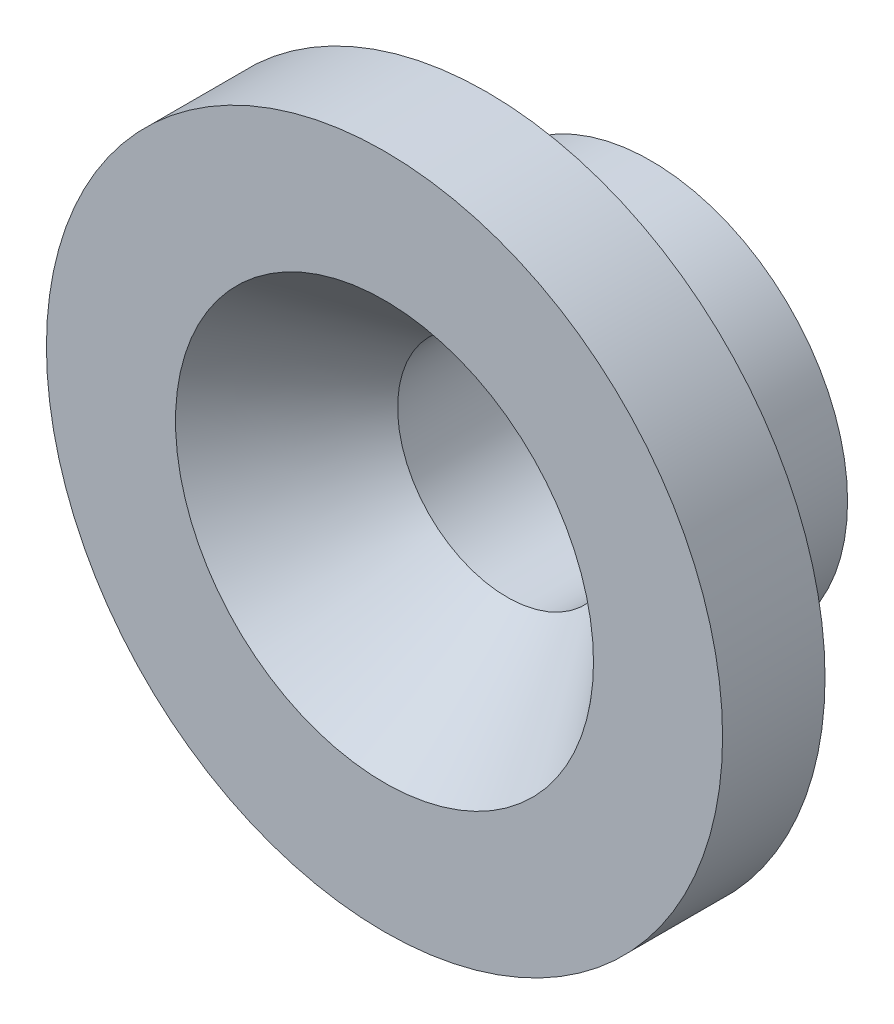
ISO-10303-21;
HEADER;
FILE_DESCRIPTION(('STEP AP214'),'2;1');
FILE_NAME('part.step','',(''),(''),'','','');
FILE_SCHEMA(('AUTOMOTIVE_DESIGN { 1 0 10303 214 1 1 1 1 }'));
ENDSEC;
DATA;
#1=APPLICATION_CONTEXT('core data for automotive mechanical design processes');
#2=APPLICATION_PROTOCOL_DEFINITION('international standard','automotive_design',2000,#1);
#3=PRODUCT_CONTEXT('',#1,'mechanical');
#4=PRODUCT('Part','Part','',(#3));
#5=PRODUCT_RELATED_PRODUCT_CATEGORY('part','',(#4));
#6=PRODUCT_DEFINITION_FORMATION('','',#4);
#7=PRODUCT_DEFINITION_CONTEXT('part definition',#1,'design');
#8=PRODUCT_DEFINITION('design','',#6,#7);
#9=PRODUCT_DEFINITION_SHAPE('','',#8);
#10=(LENGTH_UNIT() NAMED_UNIT(*) SI_UNIT(.MILLI.,.METRE.));
#11=(NAMED_UNIT(*) PLANE_ANGLE_UNIT() SI_UNIT($,.RADIAN.));
#12=(NAMED_UNIT(*) SI_UNIT($,.STERADIAN.) SOLID_ANGLE_UNIT());
#13=UNCERTAINTY_MEASURE_WITH_UNIT(LENGTH_MEASURE(1.E-05),#10,'distance_accuracy_value','');
#14=(GEOMETRIC_REPRESENTATION_CONTEXT(3) GLOBAL_UNCERTAINTY_ASSIGNED_CONTEXT((#13)) GLOBAL_UNIT_ASSIGNED_CONTEXT((#10,
#11,#12)) REPRESENTATION_CONTEXT('',''));
#15=CARTESIAN_POINT('',(0.,0.,0.));
#16=DIRECTION('',(0.,0.,1.));
#17=DIRECTION('',(1.,0.,0.));
#18=AXIS2_PLACEMENT_3D('',#15,#16,#17);
#19=CARTESIAN_POINT('',(0.,0.,4.));
#20=DIRECTION('',(0.,0.,-1.));
#21=DIRECTION('',(-1.,0.,0.));
#22=AXIS2_PLACEMENT_3D('',#19,#20,#21);
#23=CYLINDRICAL_SURFACE('',#22,4.8);
#24=CARTESIAN_POINT('',(0.,0.,4.));
#25=DIRECTION('',(0.,0.,1.));
#26=DIRECTION('',(1.,0.,0.));
#27=AXIS2_PLACEMENT_3D('',#24,#25,#26);
#28=CIRCLE('',#27,4.8);
#29=CARTESIAN_POINT('',(4.8,0.,4.));
#30=VERTEX_POINT('',#29);
#31=EDGE_CURVE('E10',#30,#30,#28,.T.);
#32=ORIENTED_EDGE('',*,*,#31,.F.);
#33=EDGE_LOOP('',(#32));
#34=FACE_BOUND('',#33,.T.);
#35=CARTESIAN_POINT('',(0.,0.,0.));
#36=DIRECTION('',(0.,0.,1.));
#37=DIRECTION('',(1.,0.,0.));
#38=AXIS2_PLACEMENT_3D('',#35,#36,#37);
#39=CIRCLE('',#38,4.8);
#40=CARTESIAN_POINT('',(4.8,0.,0.));
#41=VERTEX_POINT('',#40);
#42=EDGE_CURVE('E38',#41,#41,#39,.T.);
#43=ORIENTED_EDGE('',*,*,#42,.T.);
#44=EDGE_LOOP('',(#43));
#45=FACE_BOUND('',#44,.T.);
#46=ADVANCED_FACE('F31',(#34,#45),#23,.T.);
#47=CARTESIAN_POINT('',(0.,0.,0.));
#48=DIRECTION('',(0.,0.,1.));
#49=DIRECTION('',(1.,0.,0.));
#50=AXIS2_PLACEMENT_3D('',#47,#48,#49);
#51=PLANE('',#50);
#52=CARTESIAN_POINT('',(0.,0.,0.));
#53=DIRECTION('',(0.,0.,1.));
#54=DIRECTION('',(1.,0.,0.));
#55=AXIS2_PLACEMENT_3D('',#52,#53,#54);
#56=CIRCLE('',#55,2.675);
#57=CARTESIAN_POINT('',(2.675,0.,0.));
#58=VERTEX_POINT('',#57);
#59=EDGE_CURVE('E48',#58,#58,#56,.F.);
#60=ORIENTED_EDGE('',*,*,#59,.F.);
#61=EDGE_LOOP('',(#60));
#62=FACE_BOUND('',#61,.T.);
#63=ORIENTED_EDGE('',*,*,#42,.F.);
#64=EDGE_LOOP('',(#63));
#65=FACE_BOUND('',#64,.T.);
#66=ADVANCED_FACE('F72',(#62,#65),#51,.F.);
#67=CARTESIAN_POINT('',(0.,0.,6.5));
#68=DIRECTION('',(0.,0.,-1.));
#69=DIRECTION('',(-1.,0.,0.));
#70=AXIS2_PLACEMENT_3D('',#67,#68,#69);
#71=CYLINDRICAL_SURFACE('',#70,8.25);
#72=CARTESIAN_POINT('',(0.,0.,6.5));
#73=DIRECTION('',(0.,0.,1.));
#74=DIRECTION('',(1.,0.,0.));
#75=AXIS2_PLACEMENT_3D('',#72,#73,#74);
#76=CIRCLE('',#75,8.25);
#77=CARTESIAN_POINT('',(8.25,0.,6.5));
#78=VERTEX_POINT('',#77);
#79=EDGE_CURVE('E43',#78,#78,#76,.T.);
#80=ORIENTED_EDGE('',*,*,#79,.F.);
#81=EDGE_LOOP('',(#80));
#82=FACE_BOUND('',#81,.T.);
#83=CARTESIAN_POINT('',(0.,0.,4.));
#84=DIRECTION('',(0.,0.,1.));
#85=DIRECTION('',(1.,0.,0.));
#86=AXIS2_PLACEMENT_3D('',#83,#84,#85);
#87=CIRCLE('',#86,8.25);
#88=CARTESIAN_POINT('',(8.25,0.,4.));
#89=VERTEX_POINT('',#88);
#90=EDGE_CURVE('E45',#89,#89,#87,.T.);
#91=ORIENTED_EDGE('',*,*,#90,.T.);
#92=EDGE_LOOP('',(#91));
#93=FACE_BOUND('',#92,.T.);
#94=ADVANCED_FACE('F77',(#82,#93),#71,.T.);
#95=CARTESIAN_POINT('',(0.,0.,6.5));
#96=DIRECTION('',(0.,0.,1.));
#97=DIRECTION('',(1.,0.,0.));
#98=AXIS2_PLACEMENT_3D('',#95,#96,#97);
#99=PLANE('',#98);
#100=CARTESIAN_POINT('',(0.,0.,6.5));
#101=DIRECTION('',(0.,0.,1.));
#102=DIRECTION('',(1.,0.,0.));
#103=AXIS2_PLACEMENT_3D('',#100,#101,#102);
#104=CIRCLE('',#103,5.1);
#105=CARTESIAN_POINT('',(5.1,0.,6.5));
#106=VERTEX_POINT('',#105);
#107=EDGE_CURVE('E53',#106,#106,#104,.T.);
#108=ORIENTED_EDGE('',*,*,#107,.F.);
#109=EDGE_LOOP('',(#108));
#110=FACE_BOUND('',#109,.T.);
#111=ORIENTED_EDGE('',*,*,#79,.T.);
#112=EDGE_LOOP('',(#111));
#113=FACE_BOUND('',#112,.T.);
#114=ADVANCED_FACE('F85',(#110,#113),#99,.T.);
#115=CARTESIAN_POINT('',(0.,0.,4.));
#116=DIRECTION('',(0.,0.,1.));
#117=DIRECTION('',(1.,0.,0.));
#118=AXIS2_PLACEMENT_3D('',#115,#116,#117);
#119=PLANE('',#118);
#120=ORIENTED_EDGE('',*,*,#31,.T.);
#121=EDGE_LOOP('',(#120));
#122=FACE_BOUND('',#121,.T.);
#123=ORIENTED_EDGE('',*,*,#90,.F.);
#124=EDGE_LOOP('',(#123));
#125=FACE_BOUND('',#124,.T.);
#126=ADVANCED_FACE('F69',(#122,#125),#119,.F.);
#127=CARTESIAN_POINT('',(0.,0.,-7.56604255869606));
#128=DIRECTION('',(0.,0.,1.));
#129=DIRECTION('',(1.,0.,0.));
#130=AXIS2_PLACEMENT_3D('',#127,#128,#129);
#131=CYLINDRICAL_SURFACE('',#130,2.675);
#132=CARTESIAN_POINT('',(0.,0.,3.50537439540251));
#133=DIRECTION('',(0.,0.,1.));
#134=DIRECTION('',(1.,0.,0.));
#135=AXIS2_PLACEMENT_3D('',#132,#133,#134);
#136=CIRCLE('',#135,2.675);
#137=CARTESIAN_POINT('',(2.675,0.,3.50537439540251));
#138=VERTEX_POINT('',#137);
#139=EDGE_CURVE('E34',#138,#138,#136,.T.);
#140=ORIENTED_EDGE('',*,*,#139,.T.);
#141=EDGE_LOOP('',(#140));
#142=FACE_BOUND('',#141,.T.);
#143=ORIENTED_EDGE('',*,*,#59,.T.);
#144=EDGE_LOOP('',(#143));
#145=FACE_BOUND('',#144,.T.);
#146=ADVANCED_FACE('F60',(#142,#145),#131,.F.);
#147=CARTESIAN_POINT('',(0.,0.,6.5));
#148=DIRECTION('',(0.,0.,1.));
#149=DIRECTION('',(1.,0.,0.));
#150=AXIS2_PLACEMENT_3D('',#147,#148,#149);
#151=CONICAL_SURFACE('',#150,5.1,0.680678408277789);
#152=ORIENTED_EDGE('',*,*,#107,.T.);
#153=EDGE_LOOP('',(#152));
#154=FACE_BOUND('',#153,.T.);
#155=ORIENTED_EDGE('',*,*,#139,.F.);
#156=EDGE_LOOP('',(#155));
#157=FACE_BOUND('',#156,.T.);
#158=ADVANCED_FACE('F63',(#154,#157),#151,.F.);
#159=CLOSED_SHELL('',(#46,#66,#94,#114,#126,#146,#158));
#160=MANIFOLD_SOLID_BREP('B2',#159);
#161=ADVANCED_BREP_SHAPE_REPRESENTATION('',(#18,#160),#14);
#162=SHAPE_DEFINITION_REPRESENTATION(#9,#161);
ENDSEC;
END-ISO-10303-21;
